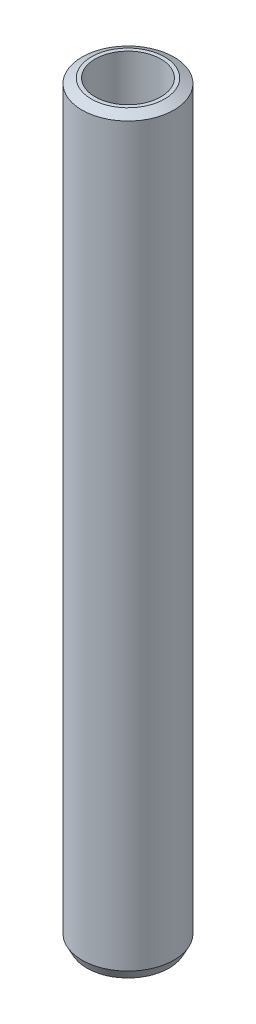
ISO-10303-21;
HEADER;
FILE_DESCRIPTION(('STEP AP214'),'2;1');
FILE_NAME('part.step','',(''),(''),'','','');
FILE_SCHEMA(('AUTOMOTIVE_DESIGN { 1 0 10303 214 1 1 1 1 }'));
ENDSEC;
DATA;
#1=APPLICATION_CONTEXT('core data for automotive mechanical design processes');
#2=APPLICATION_PROTOCOL_DEFINITION('international standard','automotive_design',2000,#1);
#3=PRODUCT_CONTEXT('',#1,'mechanical');
#4=PRODUCT('Part','Part','',(#3));
#5=PRODUCT_RELATED_PRODUCT_CATEGORY('part','',(#4));
#6=PRODUCT_DEFINITION_FORMATION('','',#4);
#7=PRODUCT_DEFINITION_CONTEXT('part definition',#1,'design');
#8=PRODUCT_DEFINITION('design','',#6,#7);
#9=PRODUCT_DEFINITION_SHAPE('','',#8);
#10=(LENGTH_UNIT() NAMED_UNIT(*) SI_UNIT(.MILLI.,.METRE.));
#11=(NAMED_UNIT(*) PLANE_ANGLE_UNIT() SI_UNIT($,.RADIAN.));
#12=(NAMED_UNIT(*) SI_UNIT($,.STERADIAN.) SOLID_ANGLE_UNIT());
#13=UNCERTAINTY_MEASURE_WITH_UNIT(LENGTH_MEASURE(1.E-05),#10,'distance_accuracy_value','');
#14=(GEOMETRIC_REPRESENTATION_CONTEXT(3) GLOBAL_UNCERTAINTY_ASSIGNED_CONTEXT((#13)) GLOBAL_UNIT_ASSIGNED_CONTEXT((#10,
#11,#12)) REPRESENTATION_CONTEXT('',''));
#15=CARTESIAN_POINT('',(0.,0.,0.));
#16=DIRECTION('',(0.,0.,1.));
#17=DIRECTION('',(1.,0.,0.));
#18=AXIS2_PLACEMENT_3D('',#15,#16,#17);
#19=CARTESIAN_POINT('',(0.,530.449344340049,0.));
#20=DIRECTION('',(0.,-1.,0.));
#21=DIRECTION('',(0.,0.,-1.));
#22=AXIS2_PLACEMENT_3D('',#19,#20,#21);
#23=CYLINDRICAL_SURFACE('',#22,32.5);
#24=CARTESIAN_POINT('',(0.,527.018614709822,0.));
#25=DIRECTION('',(0.,1.,0.));
#26=DIRECTION('',(0.,0.,1.));
#27=AXIS2_PLACEMENT_3D('',#24,#25,#26);
#28=CIRCLE('',#27,32.5);
#29=CARTESIAN_POINT('',(0.,527.018614709822,32.5));
#30=VERTEX_POINT('',#29);
#31=EDGE_CURVE('E50',#30,#30,#28,.F.);
#32=ORIENTED_EDGE('',*,*,#31,.T.);
#33=EDGE_LOOP('',(#32));
#34=FACE_BOUND('',#33,.T.);
#35=CARTESIAN_POINT('',(0.,6.63850195657656,0.));
#36=DIRECTION('',(0.,1.,0.));
#37=DIRECTION('',(0.,0.,1.));
#38=AXIS2_PLACEMENT_3D('',#35,#36,#37);
#39=CIRCLE('',#38,32.5);
#40=CARTESIAN_POINT('',(0.,6.63850195657656,32.5));
#41=VERTEX_POINT('',#40);
#42=EDGE_CURVE('E51',#41,#41,#39,.T.);
#43=ORIENTED_EDGE('',*,*,#42,.T.);
#44=EDGE_LOOP('',(#43));
#45=FACE_BOUND('',#44,.T.);
#46=ADVANCED_FACE('F39',(#34,#45),#23,.T.);
#47=CARTESIAN_POINT('',(0.,530.449344340049,0.));
#48=DIRECTION('',(0.,1.,0.));
#49=DIRECTION('',(0.,0.,1.));
#50=AXIS2_PLACEMENT_3D('',#47,#48,#49);
#51=PLANE('',#50);
#52=CARTESIAN_POINT('',(0.,530.449344340049,0.));
#53=DIRECTION('',(0.,1.,0.));
#54=DIRECTION('',(0.,0.,1.));
#55=AXIS2_PLACEMENT_3D('',#52,#53,#54);
#56=CIRCLE('',#55,25.8614980434235);
#57=CARTESIAN_POINT('',(0.,530.449344340049,25.8614980434235));
#58=VERTEX_POINT('',#57);
#59=EDGE_CURVE('E54',#58,#58,#56,.T.);
#60=ORIENTED_EDGE('',*,*,#59,.T.);
#61=EDGE_LOOP('',(#60));
#62=FACE_BOUND('',#61,.T.);
#63=CARTESIAN_POINT('',(0.,530.449344340049,0.));
#64=DIRECTION('',(0.,1.,0.));
#65=DIRECTION('',(0.,0.,1.));
#66=AXIS2_PLACEMENT_3D('',#63,#64,#65);
#67=CIRCLE('',#66,23.2295423981113);
#68=CARTESIAN_POINT('',(0.,530.449344340049,23.2295423981113));
#69=VERTEX_POINT('',#68);
#70=EDGE_CURVE('E58',#69,#69,#67,.T.);
#71=ORIENTED_EDGE('',*,*,#70,.F.);
#72=EDGE_LOOP('',(#71));
#73=FACE_BOUND('',#72,.T.);
#74=ADVANCED_FACE('F69',(#62,#73),#51,.T.);
#75=CARTESIAN_POINT('',(0.,0.,0.));
#76=DIRECTION('',(0.,1.,0.));
#77=DIRECTION('',(0.,0.,1.));
#78=AXIS2_PLACEMENT_3D('',#75,#76,#77);
#79=PLANE('',#78);
#80=CARTESIAN_POINT('',(0.,0.,0.));
#81=DIRECTION('',(0.,1.,0.));
#82=DIRECTION('',(0.,0.,1.));
#83=AXIS2_PLACEMENT_3D('',#80,#81,#82);
#84=CIRCLE('',#83,29.0692703697722);
#85=CARTESIAN_POINT('',(0.,0.,29.0692703697722));
#86=VERTEX_POINT('',#85);
#87=EDGE_CURVE('E10',#86,#86,#84,.F.);
#88=ORIENTED_EDGE('',*,*,#87,.T.);
#89=EDGE_LOOP('',(#88));
#90=FACE_BOUND('',#89,.T.);
#91=CARTESIAN_POINT('',(0.,0.,0.));
#92=DIRECTION('',(0.,1.,0.));
#93=DIRECTION('',(0.,0.,1.));
#94=AXIS2_PLACEMENT_3D('',#91,#92,#93);
#95=CIRCLE('',#94,23.2295423981113);
#96=CARTESIAN_POINT('',(0.,0.,23.2295423981113));
#97=VERTEX_POINT('',#96);
#98=EDGE_CURVE('E63',#97,#97,#95,.T.);
#99=ORIENTED_EDGE('',*,*,#98,.T.);
#100=EDGE_LOOP('',(#99));
#101=FACE_BOUND('',#100,.T.);
#102=ADVANCED_FACE('F75',(#90,#101),#79,.F.);
#103=CARTESIAN_POINT('',(0.,530.449344340049,0.));
#104=DIRECTION('',(0.,-1.,0.));
#105=DIRECTION('',(0.,0.,-1.));
#106=AXIS2_PLACEMENT_3D('',#103,#104,#105);
#107=CYLINDRICAL_SURFACE('',#106,23.2295423981113);
#108=ORIENTED_EDGE('',*,*,#70,.T.);
#109=EDGE_LOOP('',(#108));
#110=FACE_BOUND('',#109,.T.);
#111=ORIENTED_EDGE('',*,*,#98,.F.);
#112=EDGE_LOOP('',(#111));
#113=FACE_BOUND('',#112,.T.);
#114=ADVANCED_FACE('F70',(#110,#113),#107,.F.);
#115=CARTESIAN_POINT('',(0.,530.449344340049,0.));
#116=DIRECTION('',(0.,-1.,0.));
#117=DIRECTION('',(0.,0.,-1.));
#118=AXIS2_PLACEMENT_3D('',#115,#116,#117);
#119=CONICAL_SURFACE('',#118,25.8614980434235,1.093804952754);
#120=ORIENTED_EDGE('',*,*,#31,.F.);
#121=EDGE_LOOP('',(#120));
#122=FACE_BOUND('',#121,.T.);
#123=ORIENTED_EDGE('',*,*,#59,.F.);
#124=EDGE_LOOP('',(#123));
#125=FACE_BOUND('',#124,.T.);
#126=ADVANCED_FACE('F81',(#122,#125),#119,.T.);
#127=CARTESIAN_POINT('',(0.,6.63850195657656,0.));
#128=DIRECTION('',(0.,1.,0.));
#129=DIRECTION('',(0.,0.,1.));
#130=AXIS2_PLACEMENT_3D('',#127,#128,#129);
#131=CONICAL_SURFACE('',#130,32.5,0.476991374040894);
#132=CARTESIAN_POINT('',(0.,0.,29.0692703697722));
#133=CARTESIAN_POINT('',(0.,0.0691510620476716,29.1050071367537));
#134=CARTESIAN_POINT('',(0.,0.138302124095344,29.1407439037352));
#135=CARTESIAN_POINT('',(0.,0.276604248190689,29.2122174376983));
#136=CARTESIAN_POINT('',(0.,0.345755310238362,29.2479542046799));
#137=CARTESIAN_POINT('',(0.,0.484057434333707,29.3194277386429));
#138=CARTESIAN_POINT('',(0.,0.553208496381379,29.3551645056245));
#139=CARTESIAN_POINT('',(0.,0.691510620476724,29.4266380395876));
#140=CARTESIAN_POINT('',(0.,0.760661682524396,29.4623748065691));
#141=CARTESIAN_POINT('',(0.,0.898963806619742,29.5338483405322));
#142=CARTESIAN_POINT('',(0.,0.968114868667414,29.5695851075137));
#143=CARTESIAN_POINT('',(0.,1.10641699276276,29.6410586414768));
#144=CARTESIAN_POINT('',(0.,1.17556805481043,29.6767954084583));
#145=CARTESIAN_POINT('',(0.,1.31387017890578,29.7482689424214));
#146=CARTESIAN_POINT('',(0.,1.38302124095345,29.784005709403));
#147=CARTESIAN_POINT('',(0.,1.52132336504879,29.855479243366));
#148=CARTESIAN_POINT('',(0.,1.59047442709647,29.8912160103476));
#149=CARTESIAN_POINT('',(0.,1.72877655119181,29.9626895443107));
#150=CARTESIAN_POINT('',(0.,1.79792761323948,29.9984263112922));
#151=CARTESIAN_POINT('',(0.,1.93622973733483,30.0698998452553));
#152=CARTESIAN_POINT('',(0.,2.0053807993825,30.1056366122368));
#153=CARTESIAN_POINT('',(0.,2.14368292347785,30.1771101461999));
#154=CARTESIAN_POINT('',(0.,2.21283398552552,30.2128469131814));
#155=CARTESIAN_POINT('',(0.,2.35113610962086,30.2843204471445));
#156=CARTESIAN_POINT('',(0.,2.42028717166854,30.3200572141261));
#157=CARTESIAN_POINT('',(0.,2.55858929576388,30.3915307480891));
#158=CARTESIAN_POINT('',(0.,2.62774035781155,30.4272675150707));
#159=CARTESIAN_POINT('',(0.,2.7660424819069,30.4987410490338));
#160=CARTESIAN_POINT('',(0.,2.83519354395457,30.5344778160153));
#161=CARTESIAN_POINT('',(0.,2.97349566804992,30.6059513499784));
#162=CARTESIAN_POINT('',(0.,3.04264673009759,30.6416881169599));
#163=CARTESIAN_POINT('',(0.,3.18094885419293,30.713161650923));
#164=CARTESIAN_POINT('',(0.,3.25009991624061,30.7488984179045));
#165=CARTESIAN_POINT('',(0.,3.38840204033595,30.8203719518676));
#166=CARTESIAN_POINT('',(0.,3.45755310238362,30.8561087188492));
#167=CARTESIAN_POINT('',(0.,3.59585522647897,30.9275822528122));
#168=CARTESIAN_POINT('',(0.,3.66500628852664,30.9633190197938));
#169=CARTESIAN_POINT('',(0.,3.80330841262199,31.0347925537569));
#170=CARTESIAN_POINT('',(0.,3.87245947466966,31.0705293207384));
#171=CARTESIAN_POINT('',(0.,4.010761598765,31.1420028547015));
#172=CARTESIAN_POINT('',(0.,4.07991266081268,31.177739621683));
#173=CARTESIAN_POINT('',(0.,4.21821478490802,31.2492131556461));
#174=CARTESIAN_POINT('',(0.,4.28736584695569,31.2849499226276));
#175=CARTESIAN_POINT('',(0.,4.42566797105104,31.3564234565907));
#176=CARTESIAN_POINT('',(0.,4.49481903309871,31.3921602235723));
#177=CARTESIAN_POINT('',(0.,4.63312115719406,31.4636337575353));
#178=CARTESIAN_POINT('',(0.,4.70227221924173,31.4993705245169));
#179=CARTESIAN_POINT('',(0.,4.84057434333707,31.57084405848));
#180=CARTESIAN_POINT('',(0.,4.90972540538475,31.6065808254615));
#181=CARTESIAN_POINT('',(0.,5.04802752948009,31.6780543594246));
#182=CARTESIAN_POINT('',(0.,5.11717859152776,31.7137911264061));
#183=CARTESIAN_POINT('',(0.,5.25548071562311,31.7852646603692));
#184=CARTESIAN_POINT('',(0.,5.32463177767078,31.8210014273507));
#185=CARTESIAN_POINT('',(0.,5.46293390176613,31.8924749613138));
#186=CARTESIAN_POINT('',(0.,5.5320849638138,31.9282117282954));
#187=CARTESIAN_POINT('',(0.,5.67038708790914,31.9996852622584));
#188=CARTESIAN_POINT('',(0.,5.73953814995682,32.03542202924));
#189=CARTESIAN_POINT('',(0.,5.87784027405216,32.1068955632031));
#190=CARTESIAN_POINT('',(0.,5.94699133609983,32.1426323301846));
#191=CARTESIAN_POINT('',(0.,6.08529346019518,32.2141058641477));
#192=CARTESIAN_POINT('',(0.,6.15444452224285,32.2498426311292));
#193=CARTESIAN_POINT('',(0.,6.2927466463382,32.3213161650923));
#194=CARTESIAN_POINT('',(0.,6.36189770838587,32.3570529320738));
#195=CARTESIAN_POINT('',(0.,6.50019983248121,32.4285264660369));
#196=CARTESIAN_POINT('',(0.,6.56935089452889,32.4642632330185));
#197=CARTESIAN_POINT('',(0.,6.63850195657656,32.5));
#198=B_SPLINE_CURVE_WITH_KNOTS('',3,(#132,#133,#134,#135,#136,#137,#138,#139,#140,#141,#142,
#143,#144,#145,#146,#147,#148,#149,#150,#151,#152,#153,#154,#155,#156,#157,#158,#159,#160,#161,
#162,#163,#164,#165,#166,#167,#168,#169,#170,#171,#172,#173,#174,#175,#176,#177,#178,#179,#180,
#181,#182,#183,#184,#185,#186,#187,#188,#189,#190,#191,#192,#193,#194,#195,#196,#197),
.UNSPECIFIED.,.F.,.F.,(4,2,2,2,2,2,2,2,2,2,2,2,2,2,2,2,2,2,2,2,2,2,2,2,2,2,2,2,2,2,2,2,4),(0.,
0.233518464086944,0.467036928173888,0.700555392260832,0.934073856347777,1.16759232043472,
1.40111078452166,1.63462924860861,1.86814771269555,2.1016661767825,2.33518464086944,
2.56870310495639,2.80222156904333,3.03574003313027,3.26925849721722,3.50277696130416,
3.73629542539111,3.96981388947805,4.20333235356499,4.43685081765194,4.67036928173888,
4.90388774582583,5.13740620991277,5.37092467399972,5.60444313808666,5.8379616021736,
6.07148006626055,6.30499853034749,6.53851699443444,6.77203545852138,7.00555392260833,
7.23907238669527,7.47259085078222),.UNSPECIFIED.);
#199=EDGE_CURVE('BSEAM45',#86,#41,#198,.T.);
#200=ORIENTED_EDGE('',*,*,#87,.F.);
#201=ORIENTED_EDGE('',*,*,#42,.F.);
#202=ORIENTED_EDGE('',*,*,#199,.T.);
#203=ORIENTED_EDGE('',*,*,#199,.F.);
#204=EDGE_LOOP('',(#200,#202,#201,#203));
#205=FACE_BOUND('',#204,.T.);
#206=ADVANCED_FACE('F45',(#205),#131,.T.);
#207=CLOSED_SHELL('',(#46,#74,#102,#114,#126,#206));
#208=MANIFOLD_SOLID_BREP('B2',#207);
#209=ADVANCED_BREP_SHAPE_REPRESENTATION('',(#18,#208),#14);
#210=SHAPE_DEFINITION_REPRESENTATION(#9,#209);
ENDSEC;
END-ISO-10303-21;
